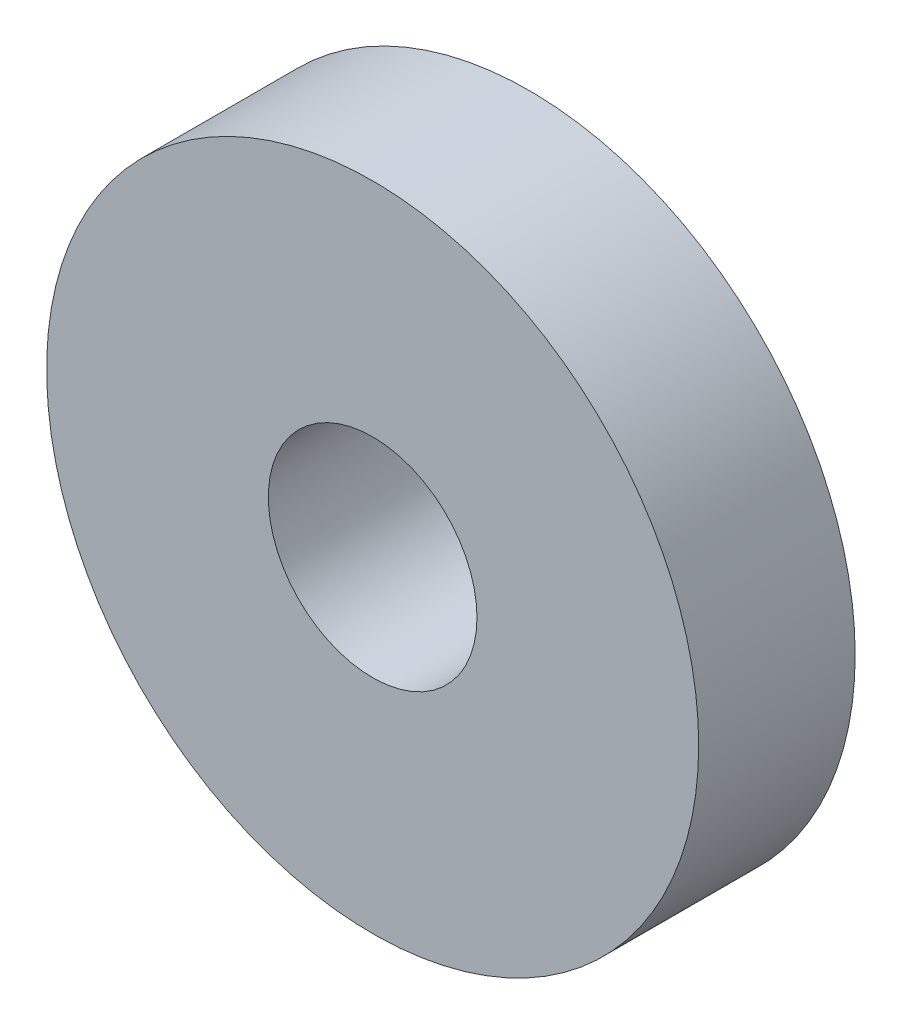
ISO-10303-21;
HEADER;
FILE_DESCRIPTION(('STEP AP214'),'2;1');
FILE_NAME('part.step','',(''),(''),'','','');
FILE_SCHEMA(('AUTOMOTIVE_DESIGN { 1 0 10303 214 1 1 1 1 }'));
ENDSEC;
DATA;
#1=APPLICATION_CONTEXT('core data for automotive mechanical design processes');
#2=APPLICATION_PROTOCOL_DEFINITION('international standard','automotive_design',2000,#1);
#3=PRODUCT_CONTEXT('',#1,'mechanical');
#4=PRODUCT('Part','Part','',(#3));
#5=PRODUCT_RELATED_PRODUCT_CATEGORY('part','',(#4));
#6=PRODUCT_DEFINITION_FORMATION('','',#4);
#7=PRODUCT_DEFINITION_CONTEXT('part definition',#1,'design');
#8=PRODUCT_DEFINITION('design','',#6,#7);
#9=PRODUCT_DEFINITION_SHAPE('','',#8);
#10=(LENGTH_UNIT() NAMED_UNIT(*) SI_UNIT(.MILLI.,.METRE.));
#11=(NAMED_UNIT(*) PLANE_ANGLE_UNIT() SI_UNIT($,.RADIAN.));
#12=(NAMED_UNIT(*) SI_UNIT($,.STERADIAN.) SOLID_ANGLE_UNIT());
#13=UNCERTAINTY_MEASURE_WITH_UNIT(LENGTH_MEASURE(1.E-05),#10,'distance_accuracy_value','');
#14=(GEOMETRIC_REPRESENTATION_CONTEXT(3) GLOBAL_UNCERTAINTY_ASSIGNED_CONTEXT((#13)) GLOBAL_UNIT_ASSIGNED_CONTEXT((#10,
#11,#12)) REPRESENTATION_CONTEXT('',''));
#15=CARTESIAN_POINT('',(0.,0.,0.));
#16=DIRECTION('',(0.,0.,1.));
#17=DIRECTION('',(1.,0.,0.));
#18=AXIS2_PLACEMENT_3D('',#15,#16,#17);
#19=CARTESIAN_POINT('',(0.,0.,12.));
#20=DIRECTION('',(0.,0.,1.));
#21=DIRECTION('',(1.,0.,0.));
#22=AXIS2_PLACEMENT_3D('',#19,#20,#21);
#23=PLANE('',#22);
#24=CARTESIAN_POINT('',(0.,0.,12.));
#25=DIRECTION('',(0.,0.,1.));
#26=DIRECTION('',(1.,0.,0.));
#27=AXIS2_PLACEMENT_3D('',#24,#25,#26);
#28=CIRCLE('',#27,25.);
#29=CARTESIAN_POINT('',(25.,0.,12.));
#30=VERTEX_POINT('',#29);
#31=EDGE_CURVE('E10',#30,#30,#28,.T.);
#32=ORIENTED_EDGE('',*,*,#31,.T.);
#33=EDGE_LOOP('',(#32));
#34=FACE_BOUND('',#33,.T.);
#35=CARTESIAN_POINT('',(0.,0.,12.));
#36=DIRECTION('',(0.,0.,1.));
#37=DIRECTION('',(1.,0.,0.));
#38=AXIS2_PLACEMENT_3D('',#35,#36,#37);
#39=CIRCLE('',#38,8.);
#40=CARTESIAN_POINT('',(8.,0.,12.));
#41=VERTEX_POINT('',#40);
#42=EDGE_CURVE('E44',#41,#41,#39,.T.);
#43=ORIENTED_EDGE('',*,*,#42,.F.);
#44=EDGE_LOOP('',(#43));
#45=FACE_BOUND('',#44,.T.);
#46=ADVANCED_FACE('F33',(#34,#45),#23,.T.);
#47=CARTESIAN_POINT('',(0.,0.,0.));
#48=DIRECTION('',(0.,0.,1.));
#49=DIRECTION('',(1.,0.,0.));
#50=AXIS2_PLACEMENT_3D('',#47,#48,#49);
#51=PLANE('',#50);
#52=CARTESIAN_POINT('',(0.,0.,0.));
#53=DIRECTION('',(0.,0.,1.));
#54=DIRECTION('',(1.,0.,0.));
#55=AXIS2_PLACEMENT_3D('',#52,#53,#54);
#56=CIRCLE('',#55,25.);
#57=CARTESIAN_POINT('',(25.,0.,0.));
#58=VERTEX_POINT('',#57);
#59=EDGE_CURVE('E37',#58,#58,#56,.T.);
#60=ORIENTED_EDGE('',*,*,#59,.F.);
#61=EDGE_LOOP('',(#60));
#62=FACE_BOUND('',#61,.T.);
#63=CARTESIAN_POINT('',(0.,0.,0.));
#64=DIRECTION('',(0.,0.,1.));
#65=DIRECTION('',(1.,0.,0.));
#66=AXIS2_PLACEMENT_3D('',#63,#64,#65);
#67=CIRCLE('',#66,8.);
#68=CARTESIAN_POINT('',(8.,0.,0.));
#69=VERTEX_POINT('',#68);
#70=EDGE_CURVE('E46',#69,#69,#67,.T.);
#71=ORIENTED_EDGE('',*,*,#70,.T.);
#72=EDGE_LOOP('',(#71));
#73=FACE_BOUND('',#72,.T.);
#74=ADVANCED_FACE('F56',(#62,#73),#51,.F.);
#75=CARTESIAN_POINT('',(0.,0.,12.));
#76=DIRECTION('',(0.,0.,-1.));
#77=DIRECTION('',(-1.,0.,0.));
#78=AXIS2_PLACEMENT_3D('',#75,#76,#77);
#79=CYLINDRICAL_SURFACE('',#78,25.);
#80=ORIENTED_EDGE('',*,*,#31,.F.);
#81=EDGE_LOOP('',(#80));
#82=FACE_BOUND('',#81,.T.);
#83=ORIENTED_EDGE('',*,*,#59,.T.);
#84=EDGE_LOOP('',(#83));
#85=FACE_BOUND('',#84,.T.);
#86=ADVANCED_FACE('F35',(#82,#85),#79,.T.);
#87=CARTESIAN_POINT('',(0.,0.,12.));
#88=DIRECTION('',(0.,0.,-1.));
#89=DIRECTION('',(-1.,0.,0.));
#90=AXIS2_PLACEMENT_3D('',#87,#88,#89);
#91=CYLINDRICAL_SURFACE('',#90,8.);
#92=ORIENTED_EDGE('',*,*,#42,.T.);
#93=EDGE_LOOP('',(#92));
#94=FACE_BOUND('',#93,.T.);
#95=ORIENTED_EDGE('',*,*,#70,.F.);
#96=EDGE_LOOP('',(#95));
#97=FACE_BOUND('',#96,.T.);
#98=ADVANCED_FACE('F52',(#94,#97),#91,.F.);
#99=CLOSED_SHELL('',(#46,#74,#86,#98));
#100=MANIFOLD_SOLID_BREP('B2',#99);
#101=ADVANCED_BREP_SHAPE_REPRESENTATION('',(#18,#100),#14);
#102=SHAPE_DEFINITION_REPRESENTATION(#9,#101);
ENDSEC;
END-ISO-10303-21;
